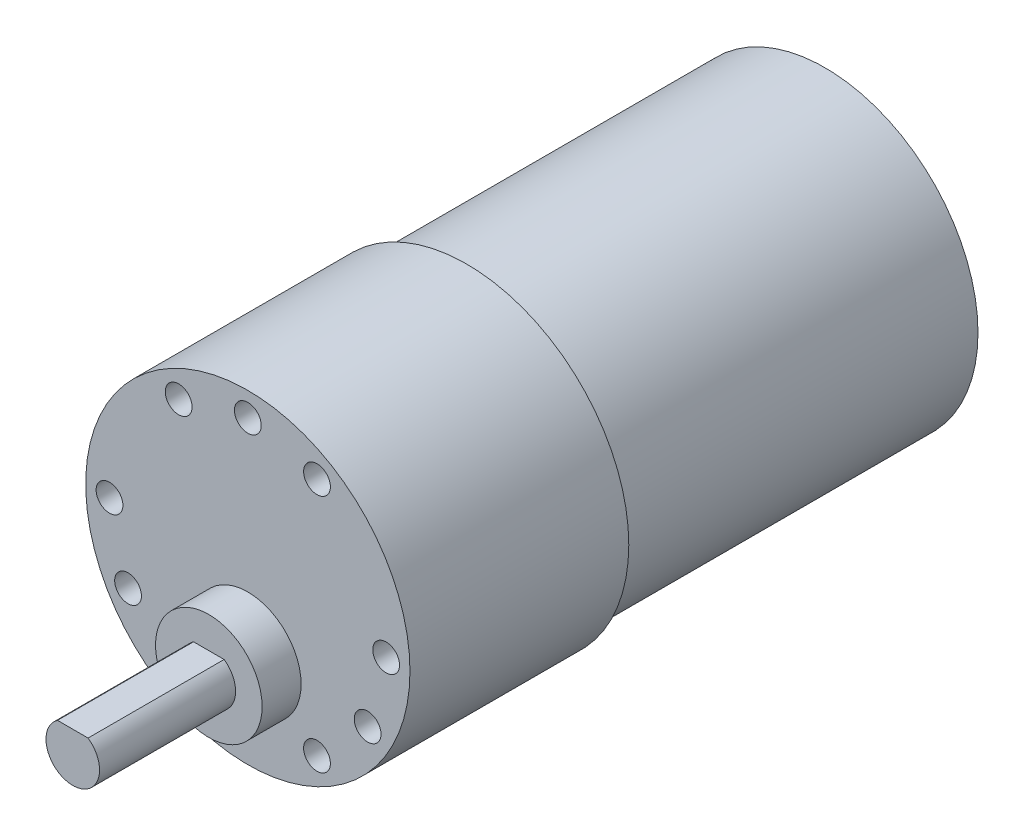
ISO-10303-21;
HEADER;
FILE_DESCRIPTION(('STEP AP214'),'2;1');
FILE_NAME('part.step','',(''),(''),'','','');
FILE_SCHEMA(('AUTOMOTIVE_DESIGN { 1 0 10303 214 1 1 1 1 }'));
ENDSEC;
DATA;
#1=APPLICATION_CONTEXT('core data for automotive mechanical design processes');
#2=APPLICATION_PROTOCOL_DEFINITION('international standard','automotive_design',2000,#1);
#3=PRODUCT_CONTEXT('',#1,'mechanical');
#4=PRODUCT('Part','Part','',(#3));
#5=PRODUCT_RELATED_PRODUCT_CATEGORY('part','',(#4));
#6=PRODUCT_DEFINITION_FORMATION('','',#4);
#7=PRODUCT_DEFINITION_CONTEXT('part definition',#1,'design');
#8=PRODUCT_DEFINITION('design','',#6,#7);
#9=PRODUCT_DEFINITION_SHAPE('','',#8);
#10=(LENGTH_UNIT() NAMED_UNIT(*) SI_UNIT(.MILLI.,.METRE.));
#11=(NAMED_UNIT(*) PLANE_ANGLE_UNIT() SI_UNIT($,.RADIAN.));
#12=(NAMED_UNIT(*) SI_UNIT($,.STERADIAN.) SOLID_ANGLE_UNIT());
#13=UNCERTAINTY_MEASURE_WITH_UNIT(LENGTH_MEASURE(1.E-05),#10,'distance_accuracy_value','');
#14=(GEOMETRIC_REPRESENTATION_CONTEXT(3) GLOBAL_UNCERTAINTY_ASSIGNED_CONTEXT((#13)) GLOBAL_UNIT_ASSIGNED_CONTEXT((#10,
#11,#12)) REPRESENTATION_CONTEXT('',''));
#15=CARTESIAN_POINT('',(0.,0.,0.));
#16=DIRECTION('',(0.,0.,1.));
#17=DIRECTION('',(1.,0.,0.));
#18=AXIS2_PLACEMENT_3D('',#15,#16,#17);
#19=CARTESIAN_POINT('',(0.,0.,-39.116));
#20=DIRECTION('',(0.,0.,-1.));
#21=DIRECTION('',(-1.,0.,0.));
#22=AXIS2_PLACEMENT_3D('',#19,#20,#21);
#23=PLANE('',#22);
#24=DIRECTION('',(0.642787609686543,-0.766044443118975,0.));
#25=VECTOR('',#24,1.);
#26=CARTESIAN_POINT('',(7.15248709016497,-8.91915603771026,-39.116));
#27=LINE('',#26,#25);
#28=CARTESIAN_POINT('',(5.51980656156115,-6.97340315218807,-39.116));
#29=VERTEX_POINT('',#28);
#30=CARTESIAN_POINT('',(7.15248709016497,-8.91915603771026,-39.116));
#31=VERTEX_POINT('',#30);
#32=EDGE_CURVE('E63',#29,#31,#27,.T.);
#33=ORIENTED_EDGE('',*,*,#32,.T.);
#34=DIRECTION('',(-0.766044443118975,-0.642787609686543,0.));
#35=VECTOR('',#34,1.);
#36=CARTESIAN_POINT('',(7.54163766726941,-8.5926199319895,-39.116));
#37=LINE('',#36,#35);
#38=CARTESIAN_POINT('',(7.54163766726941,-8.5926199319895,-39.116));
#39=VERTEX_POINT('',#38);
#40=EDGE_CURVE('E204',#39,#31,#37,.T.);
#41=ORIENTED_EDGE('',*,*,#40,.F.);
#42=DIRECTION('',(0.642787609686543,-0.766044443118975,0.));
#43=VECTOR('',#42,1.);
#44=CARTESIAN_POINT('',(7.54163766726941,-8.5926199319895,-39.116));
#45=LINE('',#44,#43);
#46=CARTESIAN_POINT('',(5.90895713866559,-6.6468670464673,-39.116));
#47=VERTEX_POINT('',#46);
#48=EDGE_CURVE('E179',#47,#39,#45,.T.);
#49=ORIENTED_EDGE('',*,*,#48,.F.);
#50=DIRECTION('',(-0.766044443118975,-0.642787609686543,0.));
#51=VECTOR('',#50,1.);
#52=CARTESIAN_POINT('',(5.90895713866559,-6.6468670464673,-39.116));
#53=LINE('',#52,#51);
#54=EDGE_CURVE('E189',#47,#29,#53,.T.);
#55=ORIENTED_EDGE('',*,*,#54,.T.);
#56=EDGE_LOOP('',(#33,#41,#49,#55));
#57=FACE_BOUND('',#56,.T.);
#58=CARTESIAN_POINT('',(0.,0.,-39.116));
#59=DIRECTION('',(0.,0.,-1.));
#60=DIRECTION('',(-1.,0.,0.));
#61=AXIS2_PLACEMENT_3D('',#58,#59,#60);
#62=CIRCLE('',#61,16.637);
#63=CARTESIAN_POINT('',(-16.637,0.,-39.116));
#64=VERTEX_POINT('',#63);
#65=EDGE_CURVE('E12',#64,#64,#62,.T.);
#66=ORIENTED_EDGE('',*,*,#65,.T.);
#67=EDGE_LOOP('',(#66));
#68=FACE_BOUND('',#67,.T.);
#69=DIRECTION('',(-0.258819045102518,-0.965925826289069,0.));
#70=VECTOR('',#69,1.);
#71=CARTESIAN_POINT('',(-2.87494665811901,-9.7480663576409,-39.116));
#72=LINE('',#71,#70);
#73=CARTESIAN_POINT('',(-2.87494665811901,-9.7480663576409,-39.116));
#74=VERTEX_POINT('',#73);
#75=CARTESIAN_POINT('',(-3.5323470326794,-12.2015179564151,-39.116));
#76=VERTEX_POINT('',#75);
#77=EDGE_CURVE('E55',#74,#76,#72,.T.);
#78=ORIENTED_EDGE('',*,*,#77,.T.);
#79=DIRECTION('',(-0.965925826289069,0.258819045102518,0.));
#80=VECTOR('',#79,1.);
#81=CARTESIAN_POINT('',(-3.04165671292456,-12.3329980313272,-39.116));
#82=LINE('',#81,#80);
#83=CARTESIAN_POINT('',(-3.04165671292456,-12.3329980313272,-39.116));
#84=VERTEX_POINT('',#83);
#85=EDGE_CURVE('E150',#84,#76,#82,.T.);
#86=ORIENTED_EDGE('',*,*,#85,.F.);
#87=DIRECTION('',(-0.258819045102518,-0.965925826289069,0.));
#88=VECTOR('',#87,1.);
#89=CARTESIAN_POINT('',(-2.38425633836416,-9.87954643255298,-39.116));
#90=LINE('',#89,#88);
#91=CARTESIAN_POINT('',(-2.38425633836416,-9.87954643255298,-39.116));
#92=VERTEX_POINT('',#91);
#93=EDGE_CURVE('E156',#92,#84,#90,.T.);
#94=ORIENTED_EDGE('',*,*,#93,.F.);
#95=DIRECTION('',(-0.965925826289069,0.258819045102518,0.));
#96=VECTOR('',#95,1.);
#97=CARTESIAN_POINT('',(-2.38425633836416,-9.87954643255298,-39.116));
#98=LINE('',#97,#96);
#99=EDGE_CURVE('E521',#92,#74,#98,.T.);
#100=ORIENTED_EDGE('',*,*,#99,.T.);
#101=EDGE_LOOP('',(#78,#86,#94,#100));
#102=FACE_BOUND('',#101,.T.);
#103=ADVANCED_FACE('F41',(#57,#68,#102),#23,.T.);
#104=CARTESIAN_POINT('',(0.,0.,-40.132));
#105=DIRECTION('',(0.,0.,-1.));
#106=DIRECTION('',(-1.,0.,0.));
#107=AXIS2_PLACEMENT_3D('',#104,#105,#106);
#108=PLANE('',#107);
#109=CARTESIAN_POINT('',(0.,0.,-40.132));
#110=DIRECTION('',(0.,0.,-1.));
#111=DIRECTION('',(-1.,0.,0.));
#112=AXIS2_PLACEMENT_3D('',#109,#110,#111);
#113=CIRCLE('',#112,16.637);
#114=CARTESIAN_POINT('',(-16.637,0.,-40.132));
#115=VERTEX_POINT('',#114);
#116=EDGE_CURVE('E48',#115,#115,#113,.T.);
#117=ORIENTED_EDGE('',*,*,#116,.F.);
#118=EDGE_LOOP('',(#117));
#119=FACE_BOUND('',#118,.T.);
#120=CARTESIAN_POINT('',(0.,0.,-40.132));
#121=DIRECTION('',(0.,0.,-1.));
#122=DIRECTION('',(-1.,0.,0.));
#123=AXIS2_PLACEMENT_3D('',#120,#121,#122);
#124=CIRCLE('',#123,17.145);
#125=CARTESIAN_POINT('',(-17.145,0.,-40.132));
#126=VERTEX_POINT('',#125);
#127=EDGE_CURVE('E207',#126,#126,#124,.T.);
#128=ORIENTED_EDGE('',*,*,#127,.T.);
#129=EDGE_LOOP('',(#128));
#130=FACE_BOUND('',#129,.T.);
#131=ADVANCED_FACE('F298',(#119,#130),#108,.T.);
#132=CARTESIAN_POINT('',(0.,0.,0.));
#133=DIRECTION('',(0.,0.,1.));
#134=DIRECTION('',(1.,0.,0.));
#135=AXIS2_PLACEMENT_3D('',#132,#133,#134);
#136=PLANE('',#135);
#137=CARTESIAN_POINT('',(0.,0.,0.));
#138=DIRECTION('',(0.,0.,1.));
#139=DIRECTION('',(1.,0.,0.));
#140=AXIS2_PLACEMENT_3D('',#137,#138,#139);
#141=CIRCLE('',#140,18.161);
#142=CARTESIAN_POINT('',(18.161,0.,0.));
#143=VERTEX_POINT('',#142);
#144=EDGE_CURVE('E212',#143,#143,#141,.T.);
#145=ORIENTED_EDGE('',*,*,#144,.F.);
#146=EDGE_LOOP('',(#145));
#147=FACE_BOUND('',#146,.T.);
#148=CARTESIAN_POINT('',(0.,0.,0.));
#149=DIRECTION('',(0.,0.,1.));
#150=DIRECTION('',(1.,0.,0.));
#151=AXIS2_PLACEMENT_3D('',#148,#149,#150);
#152=CIRCLE('',#151,17.145);
#153=CARTESIAN_POINT('',(17.145,0.,0.));
#154=VERTEX_POINT('',#153);
#155=EDGE_CURVE('E208',#154,#154,#152,.F.);
#156=ORIENTED_EDGE('',*,*,#155,.F.);
#157=EDGE_LOOP('',(#156));
#158=FACE_BOUND('',#157,.T.);
#159=ADVANCED_FACE('F301',(#147,#158),#136,.F.);
#160=CARTESIAN_POINT('',(0.,-7.366,28.8798));
#161=DIRECTION('',(0.,0.,1.));
#162=DIRECTION('',(1.,0.,0.));
#163=AXIS2_PLACEMENT_3D('',#160,#161,#162);
#164=PLANE('',#163);
#165=CARTESIAN_POINT('',(0.,-7.366,28.8798));
#166=DIRECTION('',(0.,0.,1.));
#167=DIRECTION('',(1.,0.,0.));
#168=AXIS2_PLACEMENT_3D('',#165,#166,#167);
#169=CIRCLE('',#168,5.969);
#170=CARTESIAN_POINT('',(5.969,-7.366,28.8798));
#171=VERTEX_POINT('',#170);
#172=EDGE_CURVE('E219',#171,#171,#169,.T.);
#173=ORIENTED_EDGE('',*,*,#172,.T.);
#174=EDGE_LOOP('',(#173));
#175=FACE_BOUND('',#174,.T.);
#176=DIRECTION('',(-1.,0.,0.));
#177=VECTOR('',#176,1.);
#178=CARTESIAN_POINT('',(-1.71565701700544,-4.905,28.8798));
#179=LINE('',#178,#177);
#180=CARTESIAN_POINT('',(1.71565701700544,-4.905,28.8798));
#181=VERTEX_POINT('',#180);
#182=CARTESIAN_POINT('',(-1.71565701700544,-4.905,28.8798));
#183=VERTEX_POINT('',#182);
#184=EDGE_CURVE('E229',#181,#183,#179,.T.);
#185=ORIENTED_EDGE('',*,*,#184,.F.);
#186=CARTESIAN_POINT('',(0.,-7.366,28.8798));
#187=DIRECTION('',(0.,0.,1.));
#188=DIRECTION('',(1.,0.,0.));
#189=AXIS2_PLACEMENT_3D('',#186,#187,#188);
#190=CIRCLE('',#189,3.);
#191=EDGE_CURVE('E222',#183,#181,#190,.T.);
#192=ORIENTED_EDGE('',*,*,#191,.F.);
#193=EDGE_LOOP('',(#185,#192));
#194=FACE_BOUND('',#193,.T.);
#195=ADVANCED_FACE('F313',(#175,#194),#164,.T.);
#196=CARTESIAN_POINT('',(0.,0.,24.511));
#197=DIRECTION('',(0.,0.,1.));
#198=DIRECTION('',(1.,0.,0.));
#199=AXIS2_PLACEMENT_3D('',#196,#197,#198);
#200=PLANE('',#199);
#201=CARTESIAN_POINT('',(-7.74699999999983,13.4181976062362,24.511));
#202=DIRECTION('',(0.,0.,1.));
#203=DIRECTION('',(1.,0.,0.));
#204=AXIS2_PLACEMENT_3D('',#201,#202,#203);
#205=CIRCLE('',#204,1.49999999999999);
#206=CARTESIAN_POINT('',(-6.24699999999984,13.4181976062362,24.511));
#207=VERTEX_POINT('',#206);
#208=EDGE_CURVE('E211',#207,#207,#205,.T.);
#209=ORIENTED_EDGE('',*,*,#208,.F.);
#210=EDGE_LOOP('',(#209));
#211=FACE_BOUND('',#210,.T.);
#212=CARTESIAN_POINT('',(-15.494,1.62291035592107E-13,24.511));
#213=DIRECTION('',(0.,0.,1.));
#214=DIRECTION('',(1.,0.,0.));
#215=AXIS2_PLACEMENT_3D('',#212,#213,#214);
#216=CIRCLE('',#215,1.49999999999999);
#217=CARTESIAN_POINT('',(-13.994,1.62291035592107E-13,24.511));
#218=VERTEX_POINT('',#217);
#219=EDGE_CURVE('E284',#218,#218,#216,.T.);
#220=ORIENTED_EDGE('',*,*,#219,.F.);
#221=EDGE_LOOP('',(#220));
#222=FACE_BOUND('',#221,.T.);
#223=CARTESIAN_POINT('',(-13.4181976062362,-7.74699999999987,24.511));
#224=DIRECTION('',(0.,0.,1.));
#225=DIRECTION('',(1.,0.,0.));
#226=AXIS2_PLACEMENT_3D('',#223,#224,#225);
#227=CIRCLE('',#226,1.49999999999999);
#228=CARTESIAN_POINT('',(-11.9181976062362,-7.74699999999987,24.511));
#229=VERTEX_POINT('',#228);
#230=EDGE_CURVE('E278',#229,#229,#227,.T.);
#231=ORIENTED_EDGE('',*,*,#230,.F.);
#232=EDGE_LOOP('',(#231));
#233=FACE_BOUND('',#232,.T.);
#234=CARTESIAN_POINT('',(-7.74700000000011,-13.418197606236,24.511));
#235=DIRECTION('',(0.,0.,1.));
#236=DIRECTION('',(1.,0.,0.));
#237=AXIS2_PLACEMENT_3D('',#234,#235,#236);
#238=CIRCLE('',#237,1.49999999999999);
#239=CARTESIAN_POINT('',(-6.24700000000012,-13.418197606236,24.511));
#240=VERTEX_POINT('',#239);
#241=EDGE_CURVE('E272',#240,#240,#238,.T.);
#242=ORIENTED_EDGE('',*,*,#241,.F.);
#243=EDGE_LOOP('',(#242));
#244=FACE_BOUND('',#243,.T.);
#245=CARTESIAN_POINT('',(7.74699999999992,-13.4181976062361,24.511));
#246=DIRECTION('',(0.,0.,1.));
#247=DIRECTION('',(1.,0.,0.));
#248=AXIS2_PLACEMENT_3D('',#245,#246,#247);
#249=CIRCLE('',#248,1.49999999999999);
#250=CARTESIAN_POINT('',(9.24699999999991,-13.4181976062361,24.511));
#251=VERTEX_POINT('',#250);
#252=EDGE_CURVE('E266',#251,#251,#249,.T.);
#253=ORIENTED_EDGE('',*,*,#252,.F.);
#254=EDGE_LOOP('',(#253));
#255=FACE_BOUND('',#254,.T.);
#256=CARTESIAN_POINT('',(13.4181976062361,-7.74700000000006,24.511));
#257=DIRECTION('',(0.,0.,1.));
#258=DIRECTION('',(1.,0.,0.));
#259=AXIS2_PLACEMENT_3D('',#256,#257,#258);
#260=CIRCLE('',#259,1.49999999999999);
#261=CARTESIAN_POINT('',(14.918197606236,-7.74700000000006,24.511));
#262=VERTEX_POINT('',#261);
#263=EDGE_CURVE('E260',#262,#262,#260,.T.);
#264=ORIENTED_EDGE('',*,*,#263,.F.);
#265=EDGE_LOOP('',(#264));
#266=FACE_BOUND('',#265,.T.);
#267=CARTESIAN_POINT('',(15.494,0.,24.511));
#268=DIRECTION('',(0.,0.,1.));
#269=DIRECTION('',(1.,0.,0.));
#270=AXIS2_PLACEMENT_3D('',#267,#268,#269);
#271=CIRCLE('',#270,1.49999999999999);
#272=CARTESIAN_POINT('',(16.994,0.,24.511));
#273=VERTEX_POINT('',#272);
#274=EDGE_CURVE('E254',#273,#273,#271,.T.);
#275=ORIENTED_EDGE('',*,*,#274,.F.);
#276=EDGE_LOOP('',(#275));
#277=FACE_BOUND('',#276,.T.);
#278=CARTESIAN_POINT('',(7.74700000000001,13.4181976062361,24.511));
#279=DIRECTION('',(0.,0.,1.));
#280=DIRECTION('',(1.,0.,0.));
#281=AXIS2_PLACEMENT_3D('',#278,#279,#280);
#282=CIRCLE('',#281,1.49999999999999);
#283=CARTESIAN_POINT('',(9.24700000000001,13.4181976062361,24.511));
#284=VERTEX_POINT('',#283);
#285=EDGE_CURVE('E248',#284,#284,#282,.T.);
#286=ORIENTED_EDGE('',*,*,#285,.F.);
#287=EDGE_LOOP('',(#286));
#288=FACE_BOUND('',#287,.T.);
#289=CARTESIAN_POINT('',(0.,15.494,24.511));
#290=DIRECTION('',(0.,0.,1.));
#291=DIRECTION('',(1.,0.,0.));
#292=AXIS2_PLACEMENT_3D('',#289,#290,#291);
#293=CIRCLE('',#292,1.49999999999999);
#294=CARTESIAN_POINT('',(1.49999999999999,15.494,24.511));
#295=VERTEX_POINT('',#294);
#296=EDGE_CURVE('E242',#295,#295,#293,.T.);
#297=ORIENTED_EDGE('',*,*,#296,.F.);
#298=EDGE_LOOP('',(#297));
#299=FACE_BOUND('',#298,.T.);
#300=CARTESIAN_POINT('',(0.,0.,24.511));
#301=DIRECTION('',(0.,0.,1.));
#302=DIRECTION('',(1.,0.,0.));
#303=AXIS2_PLACEMENT_3D('',#300,#301,#302);
#304=CIRCLE('',#303,18.161);
#305=CARTESIAN_POINT('',(18.161,0.,24.511));
#306=VERTEX_POINT('',#305);
#307=EDGE_CURVE('E216',#306,#306,#304,.T.);
#308=ORIENTED_EDGE('',*,*,#307,.T.);
#309=EDGE_LOOP('',(#308));
#310=FACE_BOUND('',#309,.T.);
#311=CARTESIAN_POINT('',(0.,-7.366,24.511));
#312=DIRECTION('',(0.,0.,1.));
#313=DIRECTION('',(1.,0.,0.));
#314=AXIS2_PLACEMENT_3D('',#311,#312,#313);
#315=CIRCLE('',#314,5.969);
#316=CARTESIAN_POINT('',(5.969,-7.366,24.511));
#317=VERTEX_POINT('',#316);
#318=EDGE_CURVE('E215',#317,#317,#315,.T.);
#319=ORIENTED_EDGE('',*,*,#318,.F.);
#320=EDGE_LOOP('',(#319));
#321=FACE_BOUND('',#320,.T.);
#322=ADVANCED_FACE('F319',(#211,#222,#233,#244,#255,#266,#277,#288,#299,#310,#321),#200,.T.);
#323=CARTESIAN_POINT('',(0.,0.,24.511));
#324=DIRECTION('',(0.,0.,-1.));
#325=DIRECTION('',(-1.,0.,0.));
#326=AXIS2_PLACEMENT_3D('',#323,#324,#325);
#327=CYLINDRICAL_SURFACE('',#326,18.161);
#328=ORIENTED_EDGE('',*,*,#307,.F.);
#329=EDGE_LOOP('',(#328));
#330=FACE_BOUND('',#329,.T.);
#331=ORIENTED_EDGE('',*,*,#144,.T.);
#332=EDGE_LOOP('',(#331));
#333=FACE_BOUND('',#332,.T.);
#334=ADVANCED_FACE('F427',(#330,#333),#327,.T.);
#335=CARTESIAN_POINT('',(0.,-7.366,28.8798));
#336=DIRECTION('',(0.,0.,-1.));
#337=DIRECTION('',(-1.,0.,0.));
#338=AXIS2_PLACEMENT_3D('',#335,#336,#337);
#339=CYLINDRICAL_SURFACE('',#338,5.969);
#340=ORIENTED_EDGE('',*,*,#172,.F.);
#341=EDGE_LOOP('',(#340));
#342=FACE_BOUND('',#341,.T.);
#343=ORIENTED_EDGE('',*,*,#318,.T.);
#344=EDGE_LOOP('',(#343));
#345=FACE_BOUND('',#344,.T.);
#346=ADVANCED_FACE('F423',(#342,#345),#339,.T.);
#347=CARTESIAN_POINT('',(0.,-7.366,44.1198));
#348=DIRECTION('',(0.,0.,-1.));
#349=DIRECTION('',(-1.,0.,0.));
#350=AXIS2_PLACEMENT_3D('',#347,#348,#349);
#351=CYLINDRICAL_SURFACE('',#350,3.);
#352=ORIENTED_EDGE('',*,*,#191,.T.);
#353=DIRECTION('',(0.,0.,-1.));
#354=VECTOR('',#353,1.);
#355=CARTESIAN_POINT('',(1.71565701700544,-4.905,44.1198));
#356=LINE('',#355,#354);
#357=CARTESIAN_POINT('',(1.71565701700544,-4.905,44.1198));
#358=VERTEX_POINT('',#357);
#359=EDGE_CURVE('E225',#358,#181,#356,.T.);
#360=ORIENTED_EDGE('',*,*,#359,.F.);
#361=CARTESIAN_POINT('',(0.,-7.366,44.1198));
#362=DIRECTION('',(0.,0.,1.));
#363=DIRECTION('',(1.,0.,0.));
#364=AXIS2_PLACEMENT_3D('',#361,#362,#363);
#365=CIRCLE('',#364,3.);
#366=CARTESIAN_POINT('',(-1.71565701700544,-4.905,44.1198));
#367=VERTEX_POINT('',#366);
#368=EDGE_CURVE('E228',#367,#358,#365,.T.);
#369=ORIENTED_EDGE('',*,*,#368,.F.);
#370=DIRECTION('',(0.,0.,-1.));
#371=VECTOR('',#370,1.);
#372=CARTESIAN_POINT('',(-1.71565701700544,-4.905,44.1198));
#373=LINE('',#372,#371);
#374=EDGE_CURVE('E230',#367,#183,#373,.T.);
#375=ORIENTED_EDGE('',*,*,#374,.T.);
#376=EDGE_LOOP('',(#352,#360,#369,#375));
#377=FACE_BOUND('',#376,.T.);
#378=ADVANCED_FACE('F420',(#377),#351,.T.);
#379=CARTESIAN_POINT('',(-1.71565701700544,-4.905,44.1198));
#380=DIRECTION('',(0.,-1.,0.));
#381=DIRECTION('',(0.,0.,-1.));
#382=AXIS2_PLACEMENT_3D('',#379,#380,#381);
#383=PLANE('',#382);
#384=ORIENTED_EDGE('',*,*,#184,.T.);
#385=ORIENTED_EDGE('',*,*,#374,.F.);
#386=DIRECTION('',(-1.,0.,0.));
#387=VECTOR('',#386,1.);
#388=CARTESIAN_POINT('',(-1.71565701700544,-4.905,44.1198));
#389=LINE('',#388,#387);
#390=EDGE_CURVE('E235',#358,#367,#389,.T.);
#391=ORIENTED_EDGE('',*,*,#390,.F.);
#392=ORIENTED_EDGE('',*,*,#359,.T.);
#393=EDGE_LOOP('',(#384,#385,#391,#392));
#394=FACE_BOUND('',#393,.T.);
#395=ADVANCED_FACE('F416',(#394),#383,.F.);
#396=CARTESIAN_POINT('',(0.,-7.366,44.1198));
#397=DIRECTION('',(0.,0.,1.));
#398=DIRECTION('',(1.,0.,0.));
#399=AXIS2_PLACEMENT_3D('',#396,#397,#398);
#400=PLANE('',#399);
#401=ORIENTED_EDGE('',*,*,#368,.T.);
#402=ORIENTED_EDGE('',*,*,#390,.T.);
#403=EDGE_LOOP('',(#401,#402));
#404=FACE_BOUND('',#403,.T.);
#405=ADVANCED_FACE('F412',(#404),#400,.T.);
#406=CARTESIAN_POINT('',(0.,15.494,14.351));
#407=DIRECTION('',(0.,0.,1.));
#408=DIRECTION('',(1.,0.,0.));
#409=AXIS2_PLACEMENT_3D('',#406,#407,#408);
#410=CONICAL_SURFACE('',#409,1.49999999999999,1.02974425867665);
#411=CARTESIAN_POINT('',(0.,15.494,13.4497090714587));
#412=VERTEX_POINT('',#411);
#413=VERTEX_LOOP('',#412);
#414=FACE_BOUND('',#413,.T.);
#415=CARTESIAN_POINT('',(0.,15.494,14.351));
#416=DIRECTION('',(0.,0.,1.));
#417=DIRECTION('',(1.,0.,0.));
#418=AXIS2_PLACEMENT_3D('',#415,#416,#417);
#419=CIRCLE('',#418,1.49999999999999);
#420=CARTESIAN_POINT('',(1.49999999999999,15.494,14.351));
#421=VERTEX_POINT('',#420);
#422=EDGE_CURVE('E237',#421,#421,#419,.T.);
#423=ORIENTED_EDGE('',*,*,#422,.T.);
#424=EDGE_LOOP('',(#423));
#425=FACE_BOUND('',#424,.T.);
#426=ADVANCED_FACE('F408',(#414,#425),#410,.F.);
#427=CARTESIAN_POINT('',(0.,15.494,24.511));
#428=DIRECTION('',(0.,0.,1.));
#429=DIRECTION('',(1.,0.,0.));
#430=AXIS2_PLACEMENT_3D('',#427,#428,#429);
#431=CYLINDRICAL_SURFACE('',#430,1.49999999999999);
#432=ORIENTED_EDGE('',*,*,#422,.F.);
#433=EDGE_LOOP('',(#432));
#434=FACE_BOUND('',#433,.T.);
#435=ORIENTED_EDGE('',*,*,#296,.T.);
#436=EDGE_LOOP('',(#435));
#437=FACE_BOUND('',#436,.T.);
#438=ADVANCED_FACE('F404',(#434,#437),#431,.F.);
#439=CARTESIAN_POINT('',(7.74700000000001,13.4181976062361,14.351));
#440=DIRECTION('',(0.,0.,1.));
#441=DIRECTION('',(1.,0.,0.));
#442=AXIS2_PLACEMENT_3D('',#439,#440,#441);
#443=CONICAL_SURFACE('',#442,1.49999999999999,1.02974425867665);
#444=CARTESIAN_POINT('',(7.74700000000001,13.4181976062361,13.4497090714587));
#445=VERTEX_POINT('',#444);
#446=VERTEX_LOOP('',#445);
#447=FACE_BOUND('',#446,.T.);
#448=CARTESIAN_POINT('',(7.74700000000001,13.4181976062361,14.351));
#449=DIRECTION('',(0.,0.,1.));
#450=DIRECTION('',(1.,0.,0.));
#451=AXIS2_PLACEMENT_3D('',#448,#449,#450);
#452=CIRCLE('',#451,1.49999999999999);
#453=CARTESIAN_POINT('',(9.247,13.4181976062361,14.351));
#454=VERTEX_POINT('',#453);
#455=EDGE_CURVE('E245',#454,#454,#452,.T.);
#456=ORIENTED_EDGE('',*,*,#455,.T.);
#457=EDGE_LOOP('',(#456));
#458=FACE_BOUND('',#457,.T.);
#459=ADVANCED_FACE('F400',(#447,#458),#443,.F.);
#460=CARTESIAN_POINT('',(7.74700000000001,13.4181976062361,24.511));
#461=DIRECTION('',(0.,0.,1.));
#462=DIRECTION('',(1.,0.,0.));
#463=AXIS2_PLACEMENT_3D('',#460,#461,#462);
#464=CYLINDRICAL_SURFACE('',#463,1.49999999999999);
#465=ORIENTED_EDGE('',*,*,#455,.F.);
#466=EDGE_LOOP('',(#465));
#467=FACE_BOUND('',#466,.T.);
#468=ORIENTED_EDGE('',*,*,#285,.T.);
#469=EDGE_LOOP('',(#468));
#470=FACE_BOUND('',#469,.T.);
#471=ADVANCED_FACE('F396',(#467,#470),#464,.F.);
#472=CARTESIAN_POINT('',(15.494,0.,14.351));
#473=DIRECTION('',(0.,0.,1.));
#474=DIRECTION('',(1.,0.,0.));
#475=AXIS2_PLACEMENT_3D('',#472,#473,#474);
#476=CONICAL_SURFACE('',#475,1.49999999999999,1.02974425867665);
#477=CARTESIAN_POINT('',(15.494,0.,13.4497090714587));
#478=VERTEX_POINT('',#477);
#479=VERTEX_LOOP('',#478);
#480=FACE_BOUND('',#479,.T.);
#481=CARTESIAN_POINT('',(15.494,0.,14.351));
#482=DIRECTION('',(0.,0.,1.));
#483=DIRECTION('',(1.,0.,0.));
#484=AXIS2_PLACEMENT_3D('',#481,#482,#483);
#485=CIRCLE('',#484,1.49999999999999);
#486=CARTESIAN_POINT('',(16.994,0.,14.351));
#487=VERTEX_POINT('',#486);
#488=EDGE_CURVE('E251',#487,#487,#485,.T.);
#489=ORIENTED_EDGE('',*,*,#488,.T.);
#490=EDGE_LOOP('',(#489));
#491=FACE_BOUND('',#490,.T.);
#492=ADVANCED_FACE('F392',(#480,#491),#476,.F.);
#493=CARTESIAN_POINT('',(15.494,0.,24.511));
#494=DIRECTION('',(0.,0.,1.));
#495=DIRECTION('',(1.,0.,0.));
#496=AXIS2_PLACEMENT_3D('',#493,#494,#495);
#497=CYLINDRICAL_SURFACE('',#496,1.49999999999999);
#498=ORIENTED_EDGE('',*,*,#488,.F.);
#499=EDGE_LOOP('',(#498));
#500=FACE_BOUND('',#499,.T.);
#501=ORIENTED_EDGE('',*,*,#274,.T.);
#502=EDGE_LOOP('',(#501));
#503=FACE_BOUND('',#502,.T.);
#504=ADVANCED_FACE('F388',(#500,#503),#497,.F.);
#505=CARTESIAN_POINT('',(13.4181976062361,-7.74700000000006,14.351));
#506=DIRECTION('',(0.,0.,1.));
#507=DIRECTION('',(1.,0.,0.));
#508=AXIS2_PLACEMENT_3D('',#505,#506,#507);
#509=CONICAL_SURFACE('',#508,1.49999999999999,1.02974425867665);
#510=CARTESIAN_POINT('',(13.4181976062361,-7.74700000000006,13.4497090714587));
#511=VERTEX_POINT('',#510);
#512=VERTEX_LOOP('',#511);
#513=FACE_BOUND('',#512,.T.);
#514=CARTESIAN_POINT('',(13.4181976062361,-7.74700000000006,14.351));
#515=DIRECTION('',(0.,0.,1.));
#516=DIRECTION('',(1.,0.,0.));
#517=AXIS2_PLACEMENT_3D('',#514,#515,#516);
#518=CIRCLE('',#517,1.49999999999999);
#519=CARTESIAN_POINT('',(14.918197606236,-7.74700000000006,14.351));
#520=VERTEX_POINT('',#519);
#521=EDGE_CURVE('E257',#520,#520,#518,.T.);
#522=ORIENTED_EDGE('',*,*,#521,.T.);
#523=EDGE_LOOP('',(#522));
#524=FACE_BOUND('',#523,.T.);
#525=ADVANCED_FACE('F384',(#513,#524),#509,.F.);
#526=CARTESIAN_POINT('',(13.4181976062361,-7.74700000000006,24.511));
#527=DIRECTION('',(0.,0.,1.));
#528=DIRECTION('',(1.,0.,0.));
#529=AXIS2_PLACEMENT_3D('',#526,#527,#528);
#530=CYLINDRICAL_SURFACE('',#529,1.49999999999999);
#531=ORIENTED_EDGE('',*,*,#521,.F.);
#532=EDGE_LOOP('',(#531));
#533=FACE_BOUND('',#532,.T.);
#534=ORIENTED_EDGE('',*,*,#263,.T.);
#535=EDGE_LOOP('',(#534));
#536=FACE_BOUND('',#535,.T.);
#537=ADVANCED_FACE('F380',(#533,#536),#530,.F.);
#538=CARTESIAN_POINT('',(7.74699999999992,-13.4181976062361,14.351));
#539=DIRECTION('',(0.,0.,1.));
#540=DIRECTION('',(1.,0.,0.));
#541=AXIS2_PLACEMENT_3D('',#538,#539,#540);
#542=CONICAL_SURFACE('',#541,1.49999999999999,1.02974425867665);
#543=CARTESIAN_POINT('',(7.74699999999992,-13.4181976062361,13.4497090714587));
#544=VERTEX_POINT('',#543);
#545=VERTEX_LOOP('',#544);
#546=FACE_BOUND('',#545,.T.);
#547=CARTESIAN_POINT('',(7.74699999999992,-13.4181976062361,14.351));
#548=DIRECTION('',(0.,0.,1.));
#549=DIRECTION('',(1.,0.,0.));
#550=AXIS2_PLACEMENT_3D('',#547,#548,#549);
#551=CIRCLE('',#550,1.49999999999999);
#552=CARTESIAN_POINT('',(9.24699999999991,-13.4181976062361,14.351));
#553=VERTEX_POINT('',#552);
#554=EDGE_CURVE('E263',#553,#553,#551,.T.);
#555=ORIENTED_EDGE('',*,*,#554,.T.);
#556=EDGE_LOOP('',(#555));
#557=FACE_BOUND('',#556,.T.);
#558=ADVANCED_FACE('F376',(#546,#557),#542,.F.);
#559=CARTESIAN_POINT('',(7.74699999999992,-13.4181976062361,24.511));
#560=DIRECTION('',(0.,0.,1.));
#561=DIRECTION('',(1.,0.,0.));
#562=AXIS2_PLACEMENT_3D('',#559,#560,#561);
#563=CYLINDRICAL_SURFACE('',#562,1.49999999999999);
#564=ORIENTED_EDGE('',*,*,#554,.F.);
#565=EDGE_LOOP('',(#564));
#566=FACE_BOUND('',#565,.T.);
#567=ORIENTED_EDGE('',*,*,#252,.T.);
#568=EDGE_LOOP('',(#567));
#569=FACE_BOUND('',#568,.T.);
#570=ADVANCED_FACE('F372',(#566,#569),#563,.F.);
#571=CARTESIAN_POINT('',(-7.74700000000011,-13.418197606236,14.351));
#572=DIRECTION('',(0.,0.,1.));
#573=DIRECTION('',(1.,0.,0.));
#574=AXIS2_PLACEMENT_3D('',#571,#572,#573);
#575=CONICAL_SURFACE('',#574,1.49999999999999,1.02974425867665);
#576=CARTESIAN_POINT('',(-7.74700000000011,-13.418197606236,13.4497090714587));
#577=VERTEX_POINT('',#576);
#578=VERTEX_LOOP('',#577);
#579=FACE_BOUND('',#578,.T.);
#580=CARTESIAN_POINT('',(-7.74700000000011,-13.418197606236,14.351));
#581=DIRECTION('',(0.,0.,1.));
#582=DIRECTION('',(1.,0.,0.));
#583=AXIS2_PLACEMENT_3D('',#580,#581,#582);
#584=CIRCLE('',#583,1.49999999999999);
#585=CARTESIAN_POINT('',(-6.24700000000012,-13.418197606236,14.351));
#586=VERTEX_POINT('',#585);
#587=EDGE_CURVE('E269',#586,#586,#584,.T.);
#588=ORIENTED_EDGE('',*,*,#587,.T.);
#589=EDGE_LOOP('',(#588));
#590=FACE_BOUND('',#589,.T.);
#591=ADVANCED_FACE('F368',(#579,#590),#575,.F.);
#592=CARTESIAN_POINT('',(-7.74700000000011,-13.418197606236,24.511));
#593=DIRECTION('',(0.,0.,1.));
#594=DIRECTION('',(1.,0.,0.));
#595=AXIS2_PLACEMENT_3D('',#592,#593,#594);
#596=CYLINDRICAL_SURFACE('',#595,1.49999999999999);
#597=ORIENTED_EDGE('',*,*,#587,.F.);
#598=EDGE_LOOP('',(#597));
#599=FACE_BOUND('',#598,.T.);
#600=ORIENTED_EDGE('',*,*,#241,.T.);
#601=EDGE_LOOP('',(#600));
#602=FACE_BOUND('',#601,.T.);
#603=ADVANCED_FACE('F364',(#599,#602),#596,.F.);
#604=CARTESIAN_POINT('',(-13.4181976062362,-7.74699999999987,14.351));
#605=DIRECTION('',(0.,0.,1.));
#606=DIRECTION('',(1.,0.,0.));
#607=AXIS2_PLACEMENT_3D('',#604,#605,#606);
#608=CONICAL_SURFACE('',#607,1.49999999999999,1.02974425867665);
#609=CARTESIAN_POINT('',(-13.4181976062362,-7.74699999999987,13.4497090714587));
#610=VERTEX_POINT('',#609);
#611=VERTEX_LOOP('',#610);
#612=FACE_BOUND('',#611,.T.);
#613=CARTESIAN_POINT('',(-13.4181976062362,-7.74699999999987,14.351));
#614=DIRECTION('',(0.,0.,1.));
#615=DIRECTION('',(1.,0.,0.));
#616=AXIS2_PLACEMENT_3D('',#613,#614,#615);
#617=CIRCLE('',#616,1.49999999999999);
#618=CARTESIAN_POINT('',(-11.9181976062362,-7.74699999999987,14.351));
#619=VERTEX_POINT('',#618);
#620=EDGE_CURVE('E275',#619,#619,#617,.T.);
#621=ORIENTED_EDGE('',*,*,#620,.T.);
#622=EDGE_LOOP('',(#621));
#623=FACE_BOUND('',#622,.T.);
#624=ADVANCED_FACE('F360',(#612,#623),#608,.F.);
#625=CARTESIAN_POINT('',(-13.4181976062362,-7.74699999999987,24.511));
#626=DIRECTION('',(0.,0.,1.));
#627=DIRECTION('',(1.,0.,0.));
#628=AXIS2_PLACEMENT_3D('',#625,#626,#627);
#629=CYLINDRICAL_SURFACE('',#628,1.49999999999999);
#630=ORIENTED_EDGE('',*,*,#620,.F.);
#631=EDGE_LOOP('',(#630));
#632=FACE_BOUND('',#631,.T.);
#633=ORIENTED_EDGE('',*,*,#230,.T.);
#634=EDGE_LOOP('',(#633));
#635=FACE_BOUND('',#634,.T.);
#636=ADVANCED_FACE('F356',(#632,#635),#629,.F.);
#637=CARTESIAN_POINT('',(-15.494,1.62291035592107E-13,14.351));
#638=DIRECTION('',(0.,0.,1.));
#639=DIRECTION('',(1.,0.,0.));
#640=AXIS2_PLACEMENT_3D('',#637,#638,#639);
#641=CONICAL_SURFACE('',#640,1.49999999999999,1.02974425867665);
#642=CARTESIAN_POINT('',(-15.494,1.62291035592107E-13,13.4497090714587));
#643=VERTEX_POINT('',#642);
#644=VERTEX_LOOP('',#643);
#645=FACE_BOUND('',#644,.T.);
#646=CARTESIAN_POINT('',(-15.494,1.62291035592107E-13,14.351));
#647=DIRECTION('',(0.,0.,1.));
#648=DIRECTION('',(1.,0.,0.));
#649=AXIS2_PLACEMENT_3D('',#646,#647,#648);
#650=CIRCLE('',#649,1.49999999999999);
#651=CARTESIAN_POINT('',(-13.994,1.62291035592107E-13,14.351));
#652=VERTEX_POINT('',#651);
#653=EDGE_CURVE('E281',#652,#652,#650,.T.);
#654=ORIENTED_EDGE('',*,*,#653,.T.);
#655=EDGE_LOOP('',(#654));
#656=FACE_BOUND('',#655,.T.);
#657=ADVANCED_FACE('F352',(#645,#656),#641,.F.);
#658=CARTESIAN_POINT('',(-15.494,1.62291035592107E-13,24.511));
#659=DIRECTION('',(0.,0.,1.));
#660=DIRECTION('',(1.,0.,0.));
#661=AXIS2_PLACEMENT_3D('',#658,#659,#660);
#662=CYLINDRICAL_SURFACE('',#661,1.49999999999999);
#663=ORIENTED_EDGE('',*,*,#653,.F.);
#664=EDGE_LOOP('',(#663));
#665=FACE_BOUND('',#664,.T.);
#666=ORIENTED_EDGE('',*,*,#219,.T.);
#667=EDGE_LOOP('',(#666));
#668=FACE_BOUND('',#667,.T.);
#669=ADVANCED_FACE('F348',(#665,#668),#662,.F.);
#670=CARTESIAN_POINT('',(-7.74699999999983,13.4181976062362,14.351));
#671=DIRECTION('',(0.,0.,1.));
#672=DIRECTION('',(1.,0.,0.));
#673=AXIS2_PLACEMENT_3D('',#670,#671,#672);
#674=CONICAL_SURFACE('',#673,1.49999999999999,1.02974425867665);
#675=CARTESIAN_POINT('',(-7.74699999999983,13.4181976062362,13.4497090714587));
#676=VERTEX_POINT('',#675);
#677=VERTEX_LOOP('',#676);
#678=FACE_BOUND('',#677,.T.);
#679=CARTESIAN_POINT('',(-7.74699999999983,13.4181976062362,14.351));
#680=DIRECTION('',(0.,0.,1.));
#681=DIRECTION('',(1.,0.,0.));
#682=AXIS2_PLACEMENT_3D('',#679,#680,#681);
#683=CIRCLE('',#682,1.49999999999999);
#684=CARTESIAN_POINT('',(-6.24699999999984,13.4181976062362,14.351));
#685=VERTEX_POINT('',#684);
#686=EDGE_CURVE('E287',#685,#685,#683,.T.);
#687=ORIENTED_EDGE('',*,*,#686,.T.);
#688=EDGE_LOOP('',(#687));
#689=FACE_BOUND('',#688,.T.);
#690=ADVANCED_FACE('F344',(#678,#689),#674,.F.);
#691=CARTESIAN_POINT('',(-7.74699999999983,13.4181976062362,24.511));
#692=DIRECTION('',(0.,0.,1.));
#693=DIRECTION('',(1.,0.,0.));
#694=AXIS2_PLACEMENT_3D('',#691,#692,#693);
#695=CYLINDRICAL_SURFACE('',#694,1.49999999999999);
#696=ORIENTED_EDGE('',*,*,#686,.F.);
#697=EDGE_LOOP('',(#696));
#698=FACE_BOUND('',#697,.T.);
#699=ORIENTED_EDGE('',*,*,#208,.T.);
#700=EDGE_LOOP('',(#699));
#701=FACE_BOUND('',#700,.T.);
#702=ADVANCED_FACE('F308',(#698,#701),#695,.F.);
#703=CARTESIAN_POINT('',(0.,0.,-40.132));
#704=DIRECTION('',(0.,0.,1.));
#705=DIRECTION('',(1.,0.,0.));
#706=AXIS2_PLACEMENT_3D('',#703,#704,#705);
#707=CYLINDRICAL_SURFACE('',#706,17.145);
#708=ORIENTED_EDGE('',*,*,#127,.F.);
#709=EDGE_LOOP('',(#708));
#710=FACE_BOUND('',#709,.T.);
#711=ORIENTED_EDGE('',*,*,#155,.T.);
#712=EDGE_LOOP('',(#711));
#713=FACE_BOUND('',#712,.T.);
#714=ADVANCED_FACE('F305',(#710,#713),#707,.T.);
#715=CARTESIAN_POINT('',(0.,0.,-39.116));
#716=DIRECTION('',(0.,0.,-1.));
#717=DIRECTION('',(-1.,0.,0.));
#718=AXIS2_PLACEMENT_3D('',#715,#716,#717);
#719=CYLINDRICAL_SURFACE('',#718,16.637);
#720=ORIENTED_EDGE('',*,*,#65,.F.);
#721=EDGE_LOOP('',(#720));
#722=FACE_BOUND('',#721,.T.);
#723=ORIENTED_EDGE('',*,*,#116,.T.);
#724=EDGE_LOOP('',(#723));
#725=FACE_BOUND('',#724,.T.);
#726=ADVANCED_FACE('F296',(#722,#725),#719,.F.);
#727=CARTESIAN_POINT('',(0.19457528855222,0.163268052860382,0.));
#728=DIRECTION('',(-0.766044443118975,-0.642787609686543,0.));
#729=DIRECTION('',(0.642787609686543,-0.766044443118975,0.));
#730=AXIS2_PLACEMENT_3D('',#727,#728,#729);
#731=PLANE('',#730);
#732=ORIENTED_EDGE('',*,*,#48,.T.);
#733=DIRECTION('',(0.,0.,-1.));
#734=VECTOR('',#733,1.);
#735=CARTESIAN_POINT('',(7.54163766726941,-8.5926199319895,-44.196));
#736=LINE('',#735,#734);
#737=CARTESIAN_POINT('',(7.54163766726941,-8.5926199319895,-44.196));
#738=VERTEX_POINT('',#737);
#739=EDGE_CURVE('E182',#39,#738,#736,.T.);
#740=ORIENTED_EDGE('',*,*,#739,.T.);
#741=DIRECTION('',(-0.642787609686543,0.766044443118975,0.));
#742=VECTOR('',#741,1.);
#743=CARTESIAN_POINT('',(5.90895713866559,-6.6468670464673,-44.196));
#744=LINE('',#743,#742);
#745=CARTESIAN_POINT('',(5.90895713866559,-6.6468670464673,-44.196));
#746=VERTEX_POINT('',#745);
#747=EDGE_CURVE('E185',#738,#746,#744,.T.);
#748=ORIENTED_EDGE('',*,*,#747,.T.);
#749=DIRECTION('',(0.,0.,1.));
#750=VECTOR('',#749,1.);
#751=CARTESIAN_POINT('',(5.90895713866559,-6.6468670464673,-39.116));
#752=LINE('',#751,#750);
#753=EDGE_CURVE('E187',#746,#47,#752,.T.);
#754=ORIENTED_EDGE('',*,*,#753,.T.);
#755=EDGE_LOOP('',(#732,#740,#748,#754));
#756=FACE_BOUND('',#755,.T.);
#757=CARTESIAN_POINT('',(6.7252974029675,-7.6197434892284,-42.926));
#758=DIRECTION('',(0.766044443118975,0.642787609686543,0.));
#759=DIRECTION('',(-0.642787609686543,0.766044443118975,0.));
#760=AXIS2_PLACEMENT_3D('',#757,#758,#759);
#761=CIRCLE('',#760,0.4445);
#762=CARTESIAN_POINT('',(6.43957831046183,-7.27923673426202,-42.926));
#763=VERTEX_POINT('',#762);
#764=EDGE_CURVE('E171',#763,#763,#761,.T.);
#765=ORIENTED_EDGE('',*,*,#764,.F.);
#766=EDGE_LOOP('',(#765));
#767=FACE_BOUND('',#766,.T.);
#768=ADVANCED_FACE('F334',(#756,#767),#731,.F.);
#769=CARTESIAN_POINT('',(-0.19457528855222,-0.163268052860382,0.));
#770=DIRECTION('',(-0.766044443118975,-0.642787609686543,0.));
#771=DIRECTION('',(0.642787609686543,-0.766044443118975,0.));
#772=AXIS2_PLACEMENT_3D('',#769,#770,#771);
#773=PLANE('',#772);
#774=ORIENTED_EDGE('',*,*,#32,.F.);
#775=DIRECTION('',(0.,0.,1.));
#776=VECTOR('',#775,1.);
#777=CARTESIAN_POINT('',(5.51980656156115,-6.97340315218807,-39.116));
#778=LINE('',#777,#776);
#779=CARTESIAN_POINT('',(5.51980656156115,-6.97340315218807,-44.196));
#780=VERTEX_POINT('',#779);
#781=EDGE_CURVE('E183',#780,#29,#778,.T.);
#782=ORIENTED_EDGE('',*,*,#781,.F.);
#783=DIRECTION('',(-0.642787609686543,0.766044443118975,0.));
#784=VECTOR('',#783,1.);
#785=CARTESIAN_POINT('',(5.51980656156115,-6.97340315218807,-44.196));
#786=LINE('',#785,#784);
#787=CARTESIAN_POINT('',(7.15248709016497,-8.91915603771026,-44.196));
#788=VERTEX_POINT('',#787);
#789=EDGE_CURVE('E193',#788,#780,#786,.T.);
#790=ORIENTED_EDGE('',*,*,#789,.F.);
#791=DIRECTION('',(0.,0.,-1.));
#792=VECTOR('',#791,1.);
#793=CARTESIAN_POINT('',(7.15248709016497,-8.91915603771026,-44.196));
#794=LINE('',#793,#792);
#795=EDGE_CURVE('E191',#31,#788,#794,.T.);
#796=ORIENTED_EDGE('',*,*,#795,.F.);
#797=EDGE_LOOP('',(#774,#782,#790,#796));
#798=FACE_BOUND('',#797,.T.);
#799=CARTESIAN_POINT('',(6.33614682586306,-7.94627959494917,-42.926));
#800=DIRECTION('',(0.766044443118975,0.642787609686543,0.));
#801=DIRECTION('',(-0.642787609686543,0.766044443118975,0.));
#802=AXIS2_PLACEMENT_3D('',#799,#800,#801);
#803=CIRCLE('',#802,0.4445);
#804=CARTESIAN_POINT('',(6.0504277333574,-7.60577283998278,-42.926));
#805=VERTEX_POINT('',#804);
#806=EDGE_CURVE('E168',#805,#805,#803,.T.);
#807=ORIENTED_EDGE('',*,*,#806,.T.);
#808=EDGE_LOOP('',(#807));
#809=FACE_BOUND('',#808,.T.);
#810=ADVANCED_FACE('F338',(#798,#809),#773,.T.);
#811=CARTESIAN_POINT('',(7.54163766726941,-8.5926199319895,-44.196));
#812=DIRECTION('',(-0.642787609686543,0.766044443118975,0.));
#813=DIRECTION('',(-0.766044443118975,-0.642787609686543,0.));
#814=AXIS2_PLACEMENT_3D('',#811,#812,#813);
#815=PLANE('',#814);
#816=ORIENTED_EDGE('',*,*,#795,.T.);
#817=DIRECTION('',(-0.766044443118975,-0.642787609686543,0.));
#818=VECTOR('',#817,1.);
#819=CARTESIAN_POINT('',(7.54163766726941,-8.5926199319895,-44.196));
#820=LINE('',#819,#818);
#821=EDGE_CURVE('E201',#738,#788,#820,.T.);
#822=ORIENTED_EDGE('',*,*,#821,.F.);
#823=ORIENTED_EDGE('',*,*,#739,.F.);
#824=ORIENTED_EDGE('',*,*,#40,.T.);
#825=EDGE_LOOP('',(#816,#822,#823,#824));
#826=FACE_BOUND('',#825,.T.);
#827=ADVANCED_FACE('F470',(#826),#815,.F.);
#828=CARTESIAN_POINT('',(5.90895713866559,-6.6468670464673,-44.196));
#829=DIRECTION('',(0.,0.,1.));
#830=DIRECTION('',(1.,0.,0.));
#831=AXIS2_PLACEMENT_3D('',#828,#829,#830);
#832=PLANE('',#831);
#833=ORIENTED_EDGE('',*,*,#789,.T.);
#834=DIRECTION('',(-0.766044443118975,-0.642787609686543,0.));
#835=VECTOR('',#834,1.);
#836=CARTESIAN_POINT('',(5.90895713866559,-6.6468670464673,-44.196));
#837=LINE('',#836,#835);
#838=EDGE_CURVE('E198',#746,#780,#837,.T.);
#839=ORIENTED_EDGE('',*,*,#838,.F.);
#840=ORIENTED_EDGE('',*,*,#747,.F.);
#841=ORIENTED_EDGE('',*,*,#821,.T.);
#842=EDGE_LOOP('',(#833,#839,#840,#841));
#843=FACE_BOUND('',#842,.T.);
#844=ADVANCED_FACE('F473',(#843),#832,.F.);
#845=CARTESIAN_POINT('',(5.90895713866559,-6.6468670464673,-39.116));
#846=DIRECTION('',(0.642787609686543,-0.766044443118975,0.));
#847=DIRECTION('',(0.766044443118975,0.642787609686543,0.));
#848=AXIS2_PLACEMENT_3D('',#845,#846,#847);
#849=PLANE('',#848);
#850=ORIENTED_EDGE('',*,*,#781,.T.);
#851=ORIENTED_EDGE('',*,*,#54,.F.);
#852=ORIENTED_EDGE('',*,*,#753,.F.);
#853=ORIENTED_EDGE('',*,*,#838,.T.);
#854=EDGE_LOOP('',(#850,#851,#852,#853));
#855=FACE_BOUND('',#854,.T.);
#856=ADVANCED_FACE('F477',(#855),#849,.F.);
#857=CARTESIAN_POINT('',(6.7252974029675,-7.6197434892284,-42.926));
#858=DIRECTION('',(-0.766044443118975,-0.642787609686543,0.));
#859=DIRECTION('',(0.642787609686543,-0.766044443118975,0.));
#860=AXIS2_PLACEMENT_3D('',#857,#858,#859);
#861=CYLINDRICAL_SURFACE('',#860,0.4445);
#862=ORIENTED_EDGE('',*,*,#764,.T.);
#863=EDGE_LOOP('',(#862));
#864=FACE_BOUND('',#863,.T.);
#865=ORIENTED_EDGE('',*,*,#806,.F.);
#866=EDGE_LOOP('',(#865));
#867=FACE_BOUND('',#866,.T.);
#868=ADVANCED_FACE('F481',(#864,#867),#861,.F.);
#869=CARTESIAN_POINT('',(0.245345159877424,-0.0657400374560397,0.));
#870=DIRECTION('',(0.965925826289069,-0.258819045102518,0.));
#871=DIRECTION('',(0.258819045102518,0.965925826289069,0.));
#872=AXIS2_PLACEMENT_3D('',#869,#870,#871);
#873=PLANE('',#872);
#874=ORIENTED_EDGE('',*,*,#93,.T.);
#875=DIRECTION('',(0.,0.,-1.));
#876=VECTOR('',#875,1.);
#877=CARTESIAN_POINT('',(-3.04165671292456,-12.3329980313272,-39.116));
#878=LINE('',#877,#876);
#879=CARTESIAN_POINT('',(-3.04165671292456,-12.3329980313272,-44.196));
#880=VERTEX_POINT('',#879);
#881=EDGE_CURVE('E146',#84,#880,#878,.T.);
#882=ORIENTED_EDGE('',*,*,#881,.T.);
#883=DIRECTION('',(0.258819045102518,0.965925826289069,0.));
#884=VECTOR('',#883,1.);
#885=CARTESIAN_POINT('',(-3.04165671292456,-12.3329980313272,-44.196));
#886=LINE('',#885,#884);
#887=CARTESIAN_POINT('',(-2.38425633836416,-9.87954643255298,-44.196));
#888=VERTEX_POINT('',#887);
#889=EDGE_CURVE('E155',#880,#888,#886,.T.);
#890=ORIENTED_EDGE('',*,*,#889,.T.);
#891=DIRECTION('',(0.,0.,1.));
#892=VECTOR('',#891,1.);
#893=CARTESIAN_POINT('',(-2.38425633836416,-9.87954643255298,-44.196));
#894=LINE('',#893,#892);
#895=EDGE_CURVE('E162',#888,#92,#894,.T.);
#896=ORIENTED_EDGE('',*,*,#895,.T.);
#897=EDGE_LOOP('',(#874,#882,#890,#896));
#898=FACE_BOUND('',#897,.T.);
#899=CARTESIAN_POINT('',(-2.71295652564436,-11.1062722319401,-42.926));
#900=DIRECTION('',(0.965925826289069,-0.258819045102518,0.));
#901=DIRECTION('',(0.258819045102518,0.965925826289069,0.));
#902=AXIS2_PLACEMENT_3D('',#899,#900,#901);
#903=CIRCLE('',#902,0.678606607184046);
#904=CARTESIAN_POINT('',(-2.53732021157272,-10.4507885841706,-42.926));
#905=VERTEX_POINT('',#904);
#906=EDGE_CURVE('E511',#905,#905,#903,.T.);
#907=ORIENTED_EDGE('',*,*,#906,.F.);
#908=EDGE_LOOP('',(#907));
#909=FACE_BOUND('',#908,.T.);
#910=ADVANCED_FACE('F159',(#898,#909),#873,.T.);
#911=CARTESIAN_POINT('',(-0.245345159877423,0.0657400374560395,0.));
#912=DIRECTION('',(0.965925826289069,-0.258819045102518,0.));
#913=DIRECTION('',(0.258819045102518,0.965925826289069,0.));
#914=AXIS2_PLACEMENT_3D('',#911,#912,#913);
#915=PLANE('',#914);
#916=ORIENTED_EDGE('',*,*,#77,.F.);
#917=DIRECTION('',(0.,0.,1.));
#918=VECTOR('',#917,1.);
#919=CARTESIAN_POINT('',(-2.87494665811901,-9.7480663576409,-44.196));
#920=LINE('',#919,#918);
#921=CARTESIAN_POINT('',(-2.87494665811901,-9.7480663576409,-44.196));
#922=VERTEX_POINT('',#921);
#923=EDGE_CURVE('E166',#922,#74,#920,.T.);
#924=ORIENTED_EDGE('',*,*,#923,.F.);
#925=DIRECTION('',(0.258819045102518,0.965925826289069,0.));
#926=VECTOR('',#925,1.);
#927=CARTESIAN_POINT('',(-3.5323470326794,-12.2015179564151,-44.196));
#928=LINE('',#927,#926);
#929=CARTESIAN_POINT('',(-3.5323470326794,-12.2015179564151,-44.196));
#930=VERTEX_POINT('',#929);
#931=EDGE_CURVE('E525',#930,#922,#928,.T.);
#932=ORIENTED_EDGE('',*,*,#931,.F.);
#933=DIRECTION('',(0.,0.,-1.));
#934=VECTOR('',#933,1.);
#935=CARTESIAN_POINT('',(-3.5323470326794,-12.2015179564151,-39.116));
#936=LINE('',#935,#934);
#937=EDGE_CURVE('E523',#76,#930,#936,.T.);
#938=ORIENTED_EDGE('',*,*,#937,.F.);
#939=EDGE_LOOP('',(#916,#924,#932,#938));
#940=FACE_BOUND('',#939,.T.);
#941=CARTESIAN_POINT('',(-3.2036468453992,-10.974792157028,-42.926));
#942=DIRECTION('',(0.965925826289069,-0.258819045102518,0.));
#943=DIRECTION('',(0.258819045102518,0.965925826289069,0.));
#944=AXIS2_PLACEMENT_3D('',#941,#942,#943);
#945=CIRCLE('',#944,0.678606607184046);
#946=CARTESIAN_POINT('',(-3.02801053132757,-10.3193085092585,-42.926));
#947=VERTEX_POINT('',#946);
#948=EDGE_CURVE('E514',#947,#947,#945,.T.);
#949=ORIENTED_EDGE('',*,*,#948,.T.);
#950=EDGE_LOOP('',(#949));
#951=FACE_BOUND('',#950,.T.);
#952=ADVANCED_FACE('F491',(#940,#951),#915,.F.);
#953=CARTESIAN_POINT('',(-3.04165671292456,-12.3329980313272,-39.116));
#954=DIRECTION('',(0.258819045102518,0.965925826289069,0.));
#955=DIRECTION('',(-0.965925826289069,0.258819045102518,0.));
#956=AXIS2_PLACEMENT_3D('',#953,#954,#955);
#957=PLANE('',#956);
#958=ORIENTED_EDGE('',*,*,#937,.T.);
#959=DIRECTION('',(-0.965925826289069,0.258819045102518,0.));
#960=VECTOR('',#959,1.);
#961=CARTESIAN_POINT('',(-3.04165671292456,-12.3329980313272,-44.196));
#962=LINE('',#961,#960);
#963=EDGE_CURVE('E152',#880,#930,#962,.T.);
#964=ORIENTED_EDGE('',*,*,#963,.F.);
#965=ORIENTED_EDGE('',*,*,#881,.F.);
#966=ORIENTED_EDGE('',*,*,#85,.T.);
#967=EDGE_LOOP('',(#958,#964,#965,#966));
#968=FACE_BOUND('',#967,.T.);
#969=ADVANCED_FACE('F148',(#968),#957,.F.);
#970=CARTESIAN_POINT('',(-3.04165671292456,-12.3329980313272,-44.196));
#971=DIRECTION('',(0.,0.,1.));
#972=DIRECTION('',(1.,0.,0.));
#973=AXIS2_PLACEMENT_3D('',#970,#971,#972);
#974=PLANE('',#973);
#975=ORIENTED_EDGE('',*,*,#931,.T.);
#976=DIRECTION('',(-0.965925826289069,0.258819045102518,0.));
#977=VECTOR('',#976,1.);
#978=CARTESIAN_POINT('',(-2.38425633836416,-9.87954643255298,-44.196));
#979=LINE('',#978,#977);
#980=EDGE_CURVE('E173',#888,#922,#979,.T.);
#981=ORIENTED_EDGE('',*,*,#980,.F.);
#982=ORIENTED_EDGE('',*,*,#889,.F.);
#983=ORIENTED_EDGE('',*,*,#963,.T.);
#984=EDGE_LOOP('',(#975,#981,#982,#983));
#985=FACE_BOUND('',#984,.T.);
#986=ADVANCED_FACE('F490',(#985),#974,.F.);
#987=CARTESIAN_POINT('',(-2.38425633836416,-9.87954643255298,-44.196));
#988=DIRECTION('',(-0.258819045102518,-0.965925826289069,0.));
#989=DIRECTION('',(0.965925826289069,-0.258819045102518,0.));
#990=AXIS2_PLACEMENT_3D('',#987,#988,#989);
#991=PLANE('',#990);
#992=ORIENTED_EDGE('',*,*,#923,.T.);
#993=ORIENTED_EDGE('',*,*,#99,.F.);
#994=ORIENTED_EDGE('',*,*,#895,.F.);
#995=ORIENTED_EDGE('',*,*,#980,.T.);
#996=EDGE_LOOP('',(#992,#993,#994,#995));
#997=FACE_BOUND('',#996,.T.);
#998=ADVANCED_FACE('F494',(#997),#991,.F.);
#999=CARTESIAN_POINT('',(-2.71295652564436,-11.1062722319401,-42.926));
#1000=DIRECTION('',(-0.965925826289069,0.258819045102518,0.));
#1001=DIRECTION('',(-0.258819045102518,-0.965925826289069,0.));
#1002=AXIS2_PLACEMENT_3D('',#999,#1000,#1001);
#1003=CYLINDRICAL_SURFACE('',#1002,0.678606607184046);
#1004=ORIENTED_EDGE('',*,*,#906,.T.);
#1005=EDGE_LOOP('',(#1004));
#1006=FACE_BOUND('',#1005,.T.);
#1007=ORIENTED_EDGE('',*,*,#948,.F.);
#1008=EDGE_LOOP('',(#1007));
#1009=FACE_BOUND('',#1008,.T.);
#1010=ADVANCED_FACE('F498',(#1006,#1009),#1003,.F.);
#1011=CLOSED_SHELL('',(#103,#131,#159,#195,#322,#334,#346,#378,#395,#405,#426,#438,#459,#471,
#492,#504,#525,#537,#558,#570,#591,#603,#624,#636,#657,#669,#690,#702,#714,#726,#768,#810,#827,
#844,#856,#868,#910,#952,#969,#986,#998,#1010));
#1012=MANIFOLD_SOLID_BREP('B2',#1011);
#1013=CARTESIAN_POINT('',(0.,0.,-43.942));
#1014=DIRECTION('',(0.,0.,-1.));
#1015=DIRECTION('',(-1.,0.,0.));
#1016=AXIS2_PLACEMENT_3D('',#1013,#1014,#1015);
#1017=PLANE('',#1016);
#1018=CARTESIAN_POINT('',(0.,0.,-43.942));
#1019=DIRECTION('',(0.,0.,-1.));
#1020=DIRECTION('',(-1.,0.,0.));
#1021=AXIS2_PLACEMENT_3D('',#1018,#1019,#1020);
#1022=CIRCLE('',#1021,3.048);
#1023=CARTESIAN_POINT('',(-3.048,0.,-43.942));
#1024=VERTEX_POINT('',#1023);
#1025=EDGE_CURVE('E40',#1024,#1024,#1022,.T.);
#1026=ORIENTED_EDGE('',*,*,#1025,.T.);
#1027=EDGE_LOOP('',(#1026));
#1028=FACE_BOUND('',#1027,.T.);
#1029=ADVANCED_FACE('F811',(#1028),#1017,.T.);
#1030=CARTESIAN_POINT('',(0.,0.,-43.942));
#1031=DIRECTION('',(0.,0.,1.));
#1032=DIRECTION('',(1.,0.,0.));
#1033=AXIS2_PLACEMENT_3D('',#1030,#1031,#1032);
#1034=CYLINDRICAL_SURFACE('',#1033,3.048);
#1035=ORIENTED_EDGE('',*,*,#1025,.F.);
#1036=EDGE_LOOP('',(#1035));
#1037=FACE_BOUND('',#1036,.T.);
#1038=CARTESIAN_POINT('',(0.,0.,-40.132));
#1039=DIRECTION('',(0.,0.,-1.));
#1040=DIRECTION('',(-1.,0.,0.));
#1041=AXIS2_PLACEMENT_3D('',#1038,#1039,#1040);
#1042=CIRCLE('',#1041,3.048);
#1043=CARTESIAN_POINT('',(-3.048,0.,-40.132));
#1044=VERTEX_POINT('',#1043);
#1045=EDGE_CURVE('E818',#1044,#1044,#1042,.T.);
#1046=ORIENTED_EDGE('',*,*,#1045,.T.);
#1047=EDGE_LOOP('',(#1046));
#1048=FACE_BOUND('',#1047,.T.);
#1049=ADVANCED_FACE('F813',(#1037,#1048),#1034,.T.);
#1050=CARTESIAN_POINT('',(0.,0.,-40.132));
#1051=DIRECTION('',(0.,0.,-1.));
#1052=DIRECTION('',(-1.,0.,0.));
#1053=AXIS2_PLACEMENT_3D('',#1050,#1051,#1052);
#1054=PLANE('',#1053);
#1055=ORIENTED_EDGE('',*,*,#1045,.F.);
#1056=EDGE_LOOP('',(#1055));
#1057=FACE_BOUND('',#1056,.T.);
#1058=ADVANCED_FACE('F825',(#1057),#1054,.F.);
#1059=CLOSED_SHELL('',(#1029,#1049,#1058));
#1060=MANIFOLD_SOLID_BREP('B6',#1059);
#1061=ADVANCED_BREP_SHAPE_REPRESENTATION('',(#18,#1012,#1060),#14);
#1062=SHAPE_DEFINITION_REPRESENTATION(#9,#1061);
ENDSEC;
END-ISO-10303-21;
